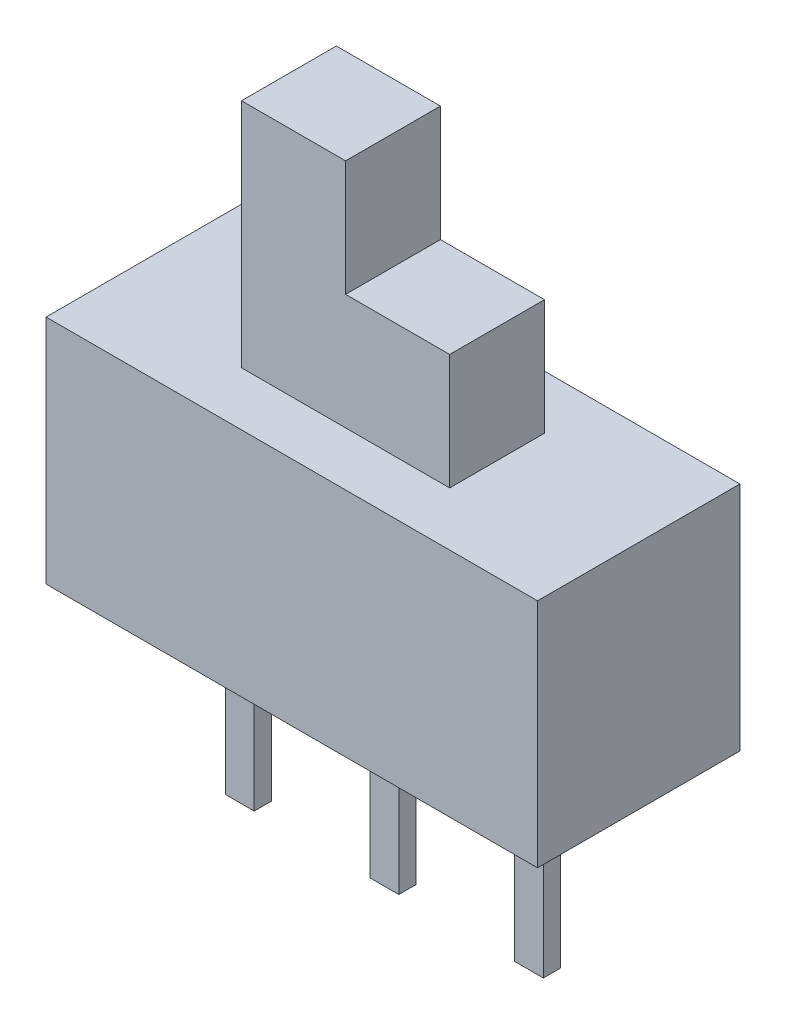
ISO-10303-21;
HEADER;
FILE_DESCRIPTION(('STEP AP214'),'2;1');
FILE_NAME('part.step','',(''),(''),'','','');
FILE_SCHEMA(('AUTOMOTIVE_DESIGN { 1 0 10303 214 1 1 1 1 }'));
ENDSEC;
DATA;
#1=APPLICATION_CONTEXT('core data for automotive mechanical design processes');
#2=APPLICATION_PROTOCOL_DEFINITION('international standard','automotive_design',2000,#1);
#3=PRODUCT_CONTEXT('',#1,'mechanical');
#4=PRODUCT('Part','Part','',(#3));
#5=PRODUCT_RELATED_PRODUCT_CATEGORY('part','',(#4));
#6=PRODUCT_DEFINITION_FORMATION('','',#4);
#7=PRODUCT_DEFINITION_CONTEXT('part definition',#1,'design');
#8=PRODUCT_DEFINITION('design','',#6,#7);
#9=PRODUCT_DEFINITION_SHAPE('','',#8);
#10=(LENGTH_UNIT() NAMED_UNIT(*) SI_UNIT(.MILLI.,.METRE.));
#11=(NAMED_UNIT(*) PLANE_ANGLE_UNIT() SI_UNIT($,.RADIAN.));
#12=(NAMED_UNIT(*) SI_UNIT($,.STERADIAN.) SOLID_ANGLE_UNIT());
#13=UNCERTAINTY_MEASURE_WITH_UNIT(LENGTH_MEASURE(1.E-05),#10,'distance_accuracy_value','');
#14=(GEOMETRIC_REPRESENTATION_CONTEXT(3) GLOBAL_UNCERTAINTY_ASSIGNED_CONTEXT((#13)) GLOBAL_UNIT_ASSIGNED_CONTEXT((#10,
#11,#12)) REPRESENTATION_CONTEXT('',''));
#15=CARTESIAN_POINT('',(0.,0.,0.));
#16=DIRECTION('',(0.,0.,1.));
#17=DIRECTION('',(1.,0.,0.));
#18=AXIS2_PLACEMENT_3D('',#15,#16,#17);
#19=CARTESIAN_POINT('',(1.8,8.,-0.82));
#20=DIRECTION('',(-1.,0.,0.));
#21=DIRECTION('',(0.,0.,1.));
#22=AXIS2_PLACEMENT_3D('',#19,#20,#21);
#23=PLANE('',#22);
#24=DIRECTION('',(0.,0.,-1.));
#25=VECTOR('',#24,1.);
#26=CARTESIAN_POINT('',(1.8,6.,-0.82));
#27=LINE('',#26,#25);
#28=CARTESIAN_POINT('',(1.8,6.,0.82));
#29=VERTEX_POINT('',#28);
#30=CARTESIAN_POINT('',(1.8,6.,-0.82));
#31=VERTEX_POINT('',#30);
#32=EDGE_CURVE('E264',#29,#31,#27,.T.);
#33=ORIENTED_EDGE('',*,*,#32,.F.);
#34=DIRECTION('',(0.,-1.,0.));
#35=VECTOR('',#34,1.);
#36=CARTESIAN_POINT('',(1.8,8.,0.82));
#37=LINE('',#36,#35);
#38=CARTESIAN_POINT('',(1.8,4.,0.82));
#39=VERTEX_POINT('',#38);
#40=EDGE_CURVE('E300',#29,#39,#37,.T.);
#41=ORIENTED_EDGE('',*,*,#40,.T.);
#42=DIRECTION('',(0.,0.,-1.));
#43=VECTOR('',#42,1.);
#44=CARTESIAN_POINT('',(1.8,4.,-0.82));
#45=LINE('',#44,#43);
#46=CARTESIAN_POINT('',(1.8,4.,-0.82));
#47=VERTEX_POINT('',#46);
#48=EDGE_CURVE('E291',#39,#47,#45,.T.);
#49=ORIENTED_EDGE('',*,*,#48,.T.);
#50=DIRECTION('',(0.,-1.,0.));
#51=VECTOR('',#50,1.);
#52=CARTESIAN_POINT('',(1.8,8.,-0.82));
#53=LINE('',#52,#51);
#54=EDGE_CURVE('E298',#31,#47,#53,.T.);
#55=ORIENTED_EDGE('',*,*,#54,.F.);
#56=EDGE_LOOP('',(#33,#41,#49,#55));
#57=FACE_BOUND('',#56,.T.);
#58=ADVANCED_FACE('F35',(#57),#23,.F.);
#59=CARTESIAN_POINT('',(4.25,4.,-1.75));
#60=DIRECTION('',(-1.,0.,0.));
#61=DIRECTION('',(0.,0.,1.));
#62=AXIS2_PLACEMENT_3D('',#59,#60,#61);
#63=PLANE('',#62);
#64=DIRECTION('',(0.,0.,-1.));
#65=VECTOR('',#64,1.);
#66=CARTESIAN_POINT('',(4.25,0.,-1.75));
#67=LINE('',#66,#65);
#68=CARTESIAN_POINT('',(4.25,0.,1.75));
#69=VERTEX_POINT('',#68);
#70=CARTESIAN_POINT('',(4.25,0.,-1.75));
#71=VERTEX_POINT('',#70);
#72=EDGE_CURVE('E305',#69,#71,#67,.T.);
#73=ORIENTED_EDGE('',*,*,#72,.T.);
#74=DIRECTION('',(0.,-1.,0.));
#75=VECTOR('',#74,1.);
#76=CARTESIAN_POINT('',(4.25,4.,-1.75));
#77=LINE('',#76,#75);
#78=CARTESIAN_POINT('',(4.25,4.,-1.75));
#79=VERTEX_POINT('',#78);
#80=EDGE_CURVE('E332',#79,#71,#77,.T.);
#81=ORIENTED_EDGE('',*,*,#80,.F.);
#82=DIRECTION('',(0.,0.,-1.));
#83=VECTOR('',#82,1.);
#84=CARTESIAN_POINT('',(4.25,4.,-1.75));
#85=LINE('',#84,#83);
#86=CARTESIAN_POINT('',(4.25,4.,1.75));
#87=VERTEX_POINT('',#86);
#88=EDGE_CURVE('E306',#87,#79,#85,.T.);
#89=ORIENTED_EDGE('',*,*,#88,.F.);
#90=DIRECTION('',(0.,-1.,0.));
#91=VECTOR('',#90,1.);
#92=CARTESIAN_POINT('',(4.25,4.,1.75));
#93=LINE('',#92,#91);
#94=EDGE_CURVE('E316',#87,#69,#93,.T.);
#95=ORIENTED_EDGE('',*,*,#94,.T.);
#96=EDGE_LOOP('',(#73,#81,#89,#95));
#97=FACE_BOUND('',#96,.T.);
#98=ADVANCED_FACE('F37',(#97),#63,.F.);
#99=CARTESIAN_POINT('',(-4.25,4.,-1.75));
#100=DIRECTION('',(0.,0.,1.));
#101=DIRECTION('',(1.,0.,0.));
#102=AXIS2_PLACEMENT_3D('',#99,#100,#101);
#103=PLANE('',#102);
#104=DIRECTION('',(-1.,0.,0.));
#105=VECTOR('',#104,1.);
#106=CARTESIAN_POINT('',(-4.25,0.,-1.75));
#107=LINE('',#106,#105);
#108=CARTESIAN_POINT('',(-4.25,0.,-1.75));
#109=VERTEX_POINT('',#108);
#110=EDGE_CURVE('E319',#71,#109,#107,.T.);
#111=ORIENTED_EDGE('',*,*,#110,.T.);
#112=DIRECTION('',(0.,-1.,0.));
#113=VECTOR('',#112,1.);
#114=CARTESIAN_POINT('',(-4.25,4.,-1.75));
#115=LINE('',#114,#113);
#116=CARTESIAN_POINT('',(-4.25,4.,-1.75));
#117=VERTEX_POINT('',#116);
#118=EDGE_CURVE('E329',#117,#109,#115,.T.);
#119=ORIENTED_EDGE('',*,*,#118,.F.);
#120=DIRECTION('',(-1.,0.,0.));
#121=VECTOR('',#120,1.);
#122=CARTESIAN_POINT('',(-4.25,4.,-1.75));
#123=LINE('',#122,#121);
#124=EDGE_CURVE('E309',#79,#117,#123,.T.);
#125=ORIENTED_EDGE('',*,*,#124,.F.);
#126=ORIENTED_EDGE('',*,*,#80,.T.);
#127=EDGE_LOOP('',(#111,#119,#125,#126));
#128=FACE_BOUND('',#127,.T.);
#129=ADVANCED_FACE('F384',(#128),#103,.F.);
#130=CARTESIAN_POINT('',(-4.25,4.,-1.75));
#131=DIRECTION('',(1.,0.,0.));
#132=DIRECTION('',(0.,0.,-1.));
#133=AXIS2_PLACEMENT_3D('',#130,#131,#132);
#134=PLANE('',#133);
#135=DIRECTION('',(0.,0.,1.));
#136=VECTOR('',#135,1.);
#137=CARTESIAN_POINT('',(-4.25,0.,-1.75));
#138=LINE('',#137,#136);
#139=CARTESIAN_POINT('',(-4.25,0.,1.75));
#140=VERTEX_POINT('',#139);
#141=EDGE_CURVE('E321',#109,#140,#138,.T.);
#142=ORIENTED_EDGE('',*,*,#141,.T.);
#143=DIRECTION('',(0.,-1.,0.));
#144=VECTOR('',#143,1.);
#145=CARTESIAN_POINT('',(-4.25,4.,1.75));
#146=LINE('',#145,#144);
#147=CARTESIAN_POINT('',(-4.25,4.,1.75));
#148=VERTEX_POINT('',#147);
#149=EDGE_CURVE('E326',#148,#140,#146,.T.);
#150=ORIENTED_EDGE('',*,*,#149,.F.);
#151=DIRECTION('',(0.,0.,1.));
#152=VECTOR('',#151,1.);
#153=CARTESIAN_POINT('',(-4.25,4.,-1.75));
#154=LINE('',#153,#152);
#155=EDGE_CURVE('E312',#117,#148,#154,.T.);
#156=ORIENTED_EDGE('',*,*,#155,.F.);
#157=ORIENTED_EDGE('',*,*,#118,.T.);
#158=EDGE_LOOP('',(#142,#150,#156,#157));
#159=FACE_BOUND('',#158,.T.);
#160=ADVANCED_FACE('F408',(#159),#134,.F.);
#161=CARTESIAN_POINT('',(-4.25,4.,1.75));
#162=DIRECTION('',(0.,0.,-1.));
#163=DIRECTION('',(-1.,0.,0.));
#164=AXIS2_PLACEMENT_3D('',#161,#162,#163);
#165=PLANE('',#164);
#166=DIRECTION('',(1.,0.,0.));
#167=VECTOR('',#166,1.);
#168=CARTESIAN_POINT('',(-4.25,0.,1.75));
#169=LINE('',#168,#167);
#170=EDGE_CURVE('E310',#140,#69,#169,.T.);
#171=ORIENTED_EDGE('',*,*,#170,.T.);
#172=ORIENTED_EDGE('',*,*,#94,.F.);
#173=DIRECTION('',(1.,0.,0.));
#174=VECTOR('',#173,1.);
#175=CARTESIAN_POINT('',(-4.25,4.,1.75));
#176=LINE('',#175,#174);
#177=EDGE_CURVE('E314',#148,#87,#176,.T.);
#178=ORIENTED_EDGE('',*,*,#177,.F.);
#179=ORIENTED_EDGE('',*,*,#149,.T.);
#180=EDGE_LOOP('',(#171,#172,#178,#179));
#181=FACE_BOUND('',#180,.T.);
#182=ADVANCED_FACE('F402',(#181),#165,.F.);
#183=CARTESIAN_POINT('',(0.,4.,0.));
#184=DIRECTION('',(0.,1.,0.));
#185=DIRECTION('',(0.,0.,1.));
#186=AXIS2_PLACEMENT_3D('',#183,#184,#185);
#187=PLANE('',#186);
#188=DIRECTION('',(0.,0.,1.));
#189=VECTOR('',#188,1.);
#190=CARTESIAN_POINT('',(-1.8,4.,-0.82));
#191=LINE('',#190,#189);
#192=CARTESIAN_POINT('',(-1.8,4.,-0.82));
#193=VERTEX_POINT('',#192);
#194=CARTESIAN_POINT('',(-1.8,4.,0.82));
#195=VERTEX_POINT('',#194);
#196=EDGE_CURVE('E273',#193,#195,#191,.T.);
#197=ORIENTED_EDGE('',*,*,#196,.F.);
#198=DIRECTION('',(-1.,0.,0.));
#199=VECTOR('',#198,1.);
#200=CARTESIAN_POINT('',(-1.8,4.,-0.82));
#201=LINE('',#200,#199);
#202=EDGE_CURVE('E280',#47,#193,#201,.T.);
#203=ORIENTED_EDGE('',*,*,#202,.F.);
#204=ORIENTED_EDGE('',*,*,#48,.F.);
#205=DIRECTION('',(1.,0.,0.));
#206=VECTOR('',#205,1.);
#207=CARTESIAN_POINT('',(-1.8,4.,0.82));
#208=LINE('',#207,#206);
#209=EDGE_CURVE('E288',#195,#39,#208,.T.);
#210=ORIENTED_EDGE('',*,*,#209,.F.);
#211=EDGE_LOOP('',(#197,#203,#204,#210));
#212=FACE_BOUND('',#211,.T.);
#213=ORIENTED_EDGE('',*,*,#88,.T.);
#214=ORIENTED_EDGE('',*,*,#124,.T.);
#215=ORIENTED_EDGE('',*,*,#155,.T.);
#216=ORIENTED_EDGE('',*,*,#177,.T.);
#217=EDGE_LOOP('',(#213,#214,#215,#216));
#218=FACE_BOUND('',#217,.T.);
#219=ADVANCED_FACE('F399',(#212,#218),#187,.T.);
#220=CARTESIAN_POINT('',(0.,0.,0.));
#221=DIRECTION('',(0.,1.,0.));
#222=DIRECTION('',(0.,0.,1.));
#223=AXIS2_PLACEMENT_3D('',#220,#221,#222);
#224=PLANE('',#223);
#225=DIRECTION('',(0.,0.,1.));
#226=VECTOR('',#225,1.);
#227=CARTESIAN_POINT('',(-2.75,0.,0.));
#228=LINE('',#227,#226);
#229=CARTESIAN_POINT('',(-2.75,0.,-0.15));
#230=VERTEX_POINT('',#229);
#231=CARTESIAN_POINT('',(-2.75,0.,0.15));
#232=VERTEX_POINT('',#231);
#233=EDGE_CURVE('E43',#230,#232,#228,.T.);
#234=ORIENTED_EDGE('',*,*,#233,.T.);
#235=DIRECTION('',(1.,0.,0.));
#236=VECTOR('',#235,1.);
#237=CARTESIAN_POINT('',(0.,0.,0.15));
#238=LINE('',#237,#236);
#239=CARTESIAN_POINT('',(-2.25,0.,0.15));
#240=VERTEX_POINT('',#239);
#241=EDGE_CURVE('E11',#232,#240,#238,.T.);
#242=ORIENTED_EDGE('',*,*,#241,.T.);
#243=DIRECTION('',(0.,0.,-1.));
#244=VECTOR('',#243,1.);
#245=CARTESIAN_POINT('',(-2.25,0.,0.));
#246=LINE('',#245,#244);
#247=CARTESIAN_POINT('',(-2.25,0.,-0.15));
#248=VERTEX_POINT('',#247);
#249=EDGE_CURVE('E187',#240,#248,#246,.T.);
#250=ORIENTED_EDGE('',*,*,#249,.T.);
#251=DIRECTION('',(-1.,0.,0.));
#252=VECTOR('',#251,1.);
#253=CARTESIAN_POINT('',(0.,0.,-0.15));
#254=LINE('',#253,#252);
#255=EDGE_CURVE('E360',#248,#230,#254,.T.);
#256=ORIENTED_EDGE('',*,*,#255,.T.);
#257=EDGE_LOOP('',(#234,#242,#250,#256));
#258=FACE_BOUND('',#257,.T.);
#259=DIRECTION('',(0.,0.,1.));
#260=VECTOR('',#259,1.);
#261=CARTESIAN_POINT('',(2.25,0.,0.));
#262=LINE('',#261,#260);
#263=CARTESIAN_POINT('',(2.25,0.,-0.15));
#264=VERTEX_POINT('',#263);
#265=CARTESIAN_POINT('',(2.25,0.,0.15));
#266=VERTEX_POINT('',#265);
#267=EDGE_CURVE('E353',#264,#266,#262,.T.);
#268=ORIENTED_EDGE('',*,*,#267,.T.);
#269=DIRECTION('',(1.,0.,0.));
#270=VECTOR('',#269,1.);
#271=CARTESIAN_POINT('',(0.,0.,0.15));
#272=LINE('',#271,#270);
#273=CARTESIAN_POINT('',(2.75,0.,0.15));
#274=VERTEX_POINT('',#273);
#275=EDGE_CURVE('E356',#266,#274,#272,.T.);
#276=ORIENTED_EDGE('',*,*,#275,.T.);
#277=DIRECTION('',(0.,0.,-1.));
#278=VECTOR('',#277,1.);
#279=CARTESIAN_POINT('',(2.75,0.,0.));
#280=LINE('',#279,#278);
#281=CARTESIAN_POINT('',(2.75,0.,-0.15));
#282=VERTEX_POINT('',#281);
#283=EDGE_CURVE('E347',#274,#282,#280,.T.);
#284=ORIENTED_EDGE('',*,*,#283,.T.);
#285=DIRECTION('',(-1.,0.,0.));
#286=VECTOR('',#285,1.);
#287=CARTESIAN_POINT('',(0.,0.,-0.15));
#288=LINE('',#287,#286);
#289=EDGE_CURVE('E350',#282,#264,#288,.T.);
#290=ORIENTED_EDGE('',*,*,#289,.T.);
#291=EDGE_LOOP('',(#268,#276,#284,#290));
#292=FACE_BOUND('',#291,.T.);
#293=DIRECTION('',(0.,0.,1.));
#294=VECTOR('',#293,1.);
#295=CARTESIAN_POINT('',(-0.25,0.,0.));
#296=LINE('',#295,#294);
#297=CARTESIAN_POINT('',(-0.25,0.,-0.15));
#298=VERTEX_POINT('',#297);
#299=CARTESIAN_POINT('',(-0.25,0.,0.15));
#300=VERTEX_POINT('',#299);
#301=EDGE_CURVE('E341',#298,#300,#296,.T.);
#302=ORIENTED_EDGE('',*,*,#301,.T.);
#303=DIRECTION('',(1.,0.,0.));
#304=VECTOR('',#303,1.);
#305=CARTESIAN_POINT('',(0.,0.,0.15));
#306=LINE('',#305,#304);
#307=CARTESIAN_POINT('',(0.25,0.,0.15));
#308=VERTEX_POINT('',#307);
#309=EDGE_CURVE('E344',#300,#308,#306,.T.);
#310=ORIENTED_EDGE('',*,*,#309,.T.);
#311=DIRECTION('',(0.,0.,-1.));
#312=VECTOR('',#311,1.);
#313=CARTESIAN_POINT('',(0.249999999999999,0.,0.));
#314=LINE('',#313,#312);
#315=CARTESIAN_POINT('',(0.249999999999999,0.,-0.15));
#316=VERTEX_POINT('',#315);
#317=EDGE_CURVE('E335',#308,#316,#314,.T.);
#318=ORIENTED_EDGE('',*,*,#317,.T.);
#319=DIRECTION('',(-1.,0.,0.));
#320=VECTOR('',#319,1.);
#321=CARTESIAN_POINT('',(0.,0.,-0.15));
#322=LINE('',#321,#320);
#323=EDGE_CURVE('E338',#316,#298,#322,.T.);
#324=ORIENTED_EDGE('',*,*,#323,.T.);
#325=EDGE_LOOP('',(#302,#310,#318,#324));
#326=FACE_BOUND('',#325,.T.);
#327=ORIENTED_EDGE('',*,*,#72,.F.);
#328=ORIENTED_EDGE('',*,*,#170,.F.);
#329=ORIENTED_EDGE('',*,*,#141,.F.);
#330=ORIENTED_EDGE('',*,*,#110,.F.);
#331=EDGE_LOOP('',(#327,#328,#329,#330));
#332=FACE_BOUND('',#331,.T.);
#333=ADVANCED_FACE('F364',(#258,#292,#326,#332),#224,.F.);
#334=CARTESIAN_POINT('',(-1.8,8.,-0.82));
#335=DIRECTION('',(1.,0.,0.));
#336=DIRECTION('',(0.,0.,-1.));
#337=AXIS2_PLACEMENT_3D('',#334,#335,#336);
#338=PLANE('',#337);
#339=ORIENTED_EDGE('',*,*,#196,.T.);
#340=DIRECTION('',(0.,-1.,0.));
#341=VECTOR('',#340,1.);
#342=CARTESIAN_POINT('',(-1.8,8.,0.82));
#343=LINE('',#342,#341);
#344=CARTESIAN_POINT('',(-1.8,8.,0.82));
#345=VERTEX_POINT('',#344);
#346=EDGE_CURVE('E302',#345,#195,#343,.T.);
#347=ORIENTED_EDGE('',*,*,#346,.F.);
#348=DIRECTION('',(0.,0.,1.));
#349=VECTOR('',#348,1.);
#350=CARTESIAN_POINT('',(-1.8,8.,-0.82));
#351=LINE('',#350,#349);
#352=CARTESIAN_POINT('',(-1.8,8.,-0.82));
#353=VERTEX_POINT('',#352);
#354=EDGE_CURVE('E276',#353,#345,#351,.T.);
#355=ORIENTED_EDGE('',*,*,#354,.F.);
#356=DIRECTION('',(0.,-1.,0.));
#357=VECTOR('',#356,1.);
#358=CARTESIAN_POINT('',(-1.8,8.,-0.82));
#359=LINE('',#358,#357);
#360=EDGE_CURVE('E285',#353,#193,#359,.T.);
#361=ORIENTED_EDGE('',*,*,#360,.T.);
#362=EDGE_LOOP('',(#339,#347,#355,#361));
#363=FACE_BOUND('',#362,.T.);
#364=ADVANCED_FACE('F394',(#363),#338,.F.);
#365=CARTESIAN_POINT('',(-1.8,8.,0.82));
#366=DIRECTION('',(0.,0.,-1.));
#367=DIRECTION('',(-1.,0.,0.));
#368=AXIS2_PLACEMENT_3D('',#365,#366,#367);
#369=PLANE('',#368);
#370=DIRECTION('',(1.,0.,0.));
#371=VECTOR('',#370,1.);
#372=CARTESIAN_POINT('',(0.,6.,0.82));
#373=LINE('',#372,#371);
#374=CARTESIAN_POINT('',(0.,6.,0.82));
#375=VERTEX_POINT('',#374);
#376=EDGE_CURVE('E262',#375,#29,#373,.T.);
#377=ORIENTED_EDGE('',*,*,#376,.F.);
#378=DIRECTION('',(0.,1.,0.));
#379=VECTOR('',#378,1.);
#380=CARTESIAN_POINT('',(0.,6.,0.82));
#381=LINE('',#380,#379);
#382=CARTESIAN_POINT('',(0.,8.,0.82));
#383=VERTEX_POINT('',#382);
#384=EDGE_CURVE('E269',#375,#383,#381,.T.);
#385=ORIENTED_EDGE('',*,*,#384,.T.);
#386=DIRECTION('',(1.,0.,0.));
#387=VECTOR('',#386,1.);
#388=CARTESIAN_POINT('',(-1.8,8.,0.82));
#389=LINE('',#388,#387);
#390=EDGE_CURVE('E279',#345,#383,#389,.T.);
#391=ORIENTED_EDGE('',*,*,#390,.F.);
#392=ORIENTED_EDGE('',*,*,#346,.T.);
#393=ORIENTED_EDGE('',*,*,#209,.T.);
#394=ORIENTED_EDGE('',*,*,#40,.F.);
#395=EDGE_LOOP('',(#377,#385,#391,#392,#393,#394));
#396=FACE_BOUND('',#395,.T.);
#397=ADVANCED_FACE('F391',(#396),#369,.F.);
#398=CARTESIAN_POINT('',(-1.8,8.,-0.82));
#399=DIRECTION('',(0.,0.,1.));
#400=DIRECTION('',(1.,0.,0.));
#401=AXIS2_PLACEMENT_3D('',#398,#399,#400);
#402=PLANE('',#401);
#403=DIRECTION('',(-1.,0.,0.));
#404=VECTOR('',#403,1.);
#405=CARTESIAN_POINT('',(-1.8,8.,-0.82));
#406=LINE('',#405,#404);
#407=CARTESIAN_POINT('',(0.,8.,-0.82));
#408=VERTEX_POINT('',#407);
#409=EDGE_CURVE('E283',#408,#353,#406,.T.);
#410=ORIENTED_EDGE('',*,*,#409,.F.);
#411=DIRECTION('',(0.,1.,0.));
#412=VECTOR('',#411,1.);
#413=CARTESIAN_POINT('',(0.,6.,-0.82));
#414=LINE('',#413,#412);
#415=CARTESIAN_POINT('',(0.,6.,-0.82));
#416=VERTEX_POINT('',#415);
#417=EDGE_CURVE('E271',#416,#408,#414,.T.);
#418=ORIENTED_EDGE('',*,*,#417,.F.);
#419=DIRECTION('',(-1.,0.,0.));
#420=VECTOR('',#419,1.);
#421=CARTESIAN_POINT('',(0.,6.,-0.82));
#422=LINE('',#421,#420);
#423=EDGE_CURVE('E266',#31,#416,#422,.T.);
#424=ORIENTED_EDGE('',*,*,#423,.F.);
#425=ORIENTED_EDGE('',*,*,#54,.T.);
#426=ORIENTED_EDGE('',*,*,#202,.T.);
#427=ORIENTED_EDGE('',*,*,#360,.F.);
#428=EDGE_LOOP('',(#410,#418,#424,#425,#426,#427));
#429=FACE_BOUND('',#428,.T.);
#430=ADVANCED_FACE('F389',(#429),#402,.F.);
#431=CARTESIAN_POINT('',(0.,8.,0.));
#432=DIRECTION('',(0.,1.,0.));
#433=DIRECTION('',(0.,0.,1.));
#434=AXIS2_PLACEMENT_3D('',#431,#432,#433);
#435=PLANE('',#434);
#436=DIRECTION('',(0.,0.,1.));
#437=VECTOR('',#436,1.);
#438=CARTESIAN_POINT('',(0.,8.,-0.82));
#439=LINE('',#438,#437);
#440=EDGE_CURVE('E251',#408,#383,#439,.T.);
#441=ORIENTED_EDGE('',*,*,#440,.F.);
#442=ORIENTED_EDGE('',*,*,#409,.T.);
#443=ORIENTED_EDGE('',*,*,#354,.T.);
#444=ORIENTED_EDGE('',*,*,#390,.T.);
#445=EDGE_LOOP('',(#441,#442,#443,#444));
#446=FACE_BOUND('',#445,.T.);
#447=ADVANCED_FACE('F462',(#446),#435,.T.);
#448=CARTESIAN_POINT('',(0.,6.,-0.82));
#449=DIRECTION('',(-1.,0.,0.));
#450=DIRECTION('',(0.,0.,1.));
#451=AXIS2_PLACEMENT_3D('',#448,#449,#450);
#452=PLANE('',#451);
#453=ORIENTED_EDGE('',*,*,#440,.T.);
#454=ORIENTED_EDGE('',*,*,#384,.F.);
#455=DIRECTION('',(0.,0.,1.));
#456=VECTOR('',#455,1.);
#457=CARTESIAN_POINT('',(0.,6.,-0.82));
#458=LINE('',#457,#456);
#459=EDGE_CURVE('E259',#416,#375,#458,.T.);
#460=ORIENTED_EDGE('',*,*,#459,.F.);
#461=ORIENTED_EDGE('',*,*,#417,.T.);
#462=EDGE_LOOP('',(#453,#454,#460,#461));
#463=FACE_BOUND('',#462,.T.);
#464=ADVANCED_FACE('F469',(#463),#452,.F.);
#465=CARTESIAN_POINT('',(0.,6.,0.));
#466=DIRECTION('',(0.,1.,0.));
#467=DIRECTION('',(0.,0.,1.));
#468=AXIS2_PLACEMENT_3D('',#465,#466,#467);
#469=PLANE('',#468);
#470=ORIENTED_EDGE('',*,*,#459,.T.);
#471=ORIENTED_EDGE('',*,*,#376,.T.);
#472=ORIENTED_EDGE('',*,*,#32,.T.);
#473=ORIENTED_EDGE('',*,*,#423,.T.);
#474=EDGE_LOOP('',(#470,#471,#472,#473));
#475=FACE_BOUND('',#474,.T.);
#476=ADVANCED_FACE('F476',(#475),#469,.T.);
#477=CARTESIAN_POINT('',(0.,-3.2,0.15));
#478=DIRECTION('',(0.,0.,1.));
#479=DIRECTION('',(1.,0.,0.));
#480=AXIS2_PLACEMENT_3D('',#477,#478,#479);
#481=PLANE('',#480);
#482=ORIENTED_EDGE('',*,*,#309,.F.);
#483=DIRECTION('',(0.,1.,0.));
#484=VECTOR('',#483,1.);
#485=CARTESIAN_POINT('',(-0.25,-3.2,0.15));
#486=LINE('',#485,#484);
#487=CARTESIAN_POINT('',(-0.25,-3.2,0.15));
#488=VERTEX_POINT('',#487);
#489=EDGE_CURVE('E248',#488,#300,#486,.T.);
#490=ORIENTED_EDGE('',*,*,#489,.F.);
#491=DIRECTION('',(1.,0.,0.));
#492=VECTOR('',#491,1.);
#493=CARTESIAN_POINT('',(0.,-3.2,0.15));
#494=LINE('',#493,#492);
#495=CARTESIAN_POINT('',(0.25,-3.2,0.15));
#496=VERTEX_POINT('',#495);
#497=EDGE_CURVE('E229',#488,#496,#494,.T.);
#498=ORIENTED_EDGE('',*,*,#497,.T.);
#499=DIRECTION('',(0.,1.,0.));
#500=VECTOR('',#499,1.);
#501=CARTESIAN_POINT('',(0.25,-3.2,0.15));
#502=LINE('',#501,#500);
#503=EDGE_CURVE('E247',#496,#308,#502,.T.);
#504=ORIENTED_EDGE('',*,*,#503,.T.);
#505=EDGE_LOOP('',(#482,#490,#498,#504));
#506=FACE_BOUND('',#505,.T.);
#507=ADVANCED_FACE('F483',(#506),#481,.T.);
#508=CARTESIAN_POINT('',(-0.25,-3.2,0.));
#509=DIRECTION('',(-1.,0.,0.));
#510=DIRECTION('',(0.,0.,1.));
#511=AXIS2_PLACEMENT_3D('',#508,#509,#510);
#512=PLANE('',#511);
#513=ORIENTED_EDGE('',*,*,#301,.F.);
#514=DIRECTION('',(0.,1.,0.));
#515=VECTOR('',#514,1.);
#516=CARTESIAN_POINT('',(-0.25,-3.2,-0.15));
#517=LINE('',#516,#515);
#518=CARTESIAN_POINT('',(-0.25,-3.2,-0.15));
#519=VERTEX_POINT('',#518);
#520=EDGE_CURVE('E252',#519,#298,#517,.T.);
#521=ORIENTED_EDGE('',*,*,#520,.F.);
#522=DIRECTION('',(0.,0.,1.));
#523=VECTOR('',#522,1.);
#524=CARTESIAN_POINT('',(-0.25,-3.2,0.));
#525=LINE('',#524,#523);
#526=EDGE_CURVE('E244',#519,#488,#525,.T.);
#527=ORIENTED_EDGE('',*,*,#526,.T.);
#528=ORIENTED_EDGE('',*,*,#489,.T.);
#529=EDGE_LOOP('',(#513,#521,#527,#528));
#530=FACE_BOUND('',#529,.T.);
#531=ADVANCED_FACE('F490',(#530),#512,.T.);
#532=CARTESIAN_POINT('',(0.,-3.2,-0.15));
#533=DIRECTION('',(0.,0.,-1.));
#534=DIRECTION('',(-1.,0.,0.));
#535=AXIS2_PLACEMENT_3D('',#532,#533,#534);
#536=PLANE('',#535);
#537=ORIENTED_EDGE('',*,*,#323,.F.);
#538=DIRECTION('',(0.,1.,0.));
#539=VECTOR('',#538,1.);
#540=CARTESIAN_POINT('',(0.249999999999999,-3.2,-0.15));
#541=LINE('',#540,#539);
#542=CARTESIAN_POINT('',(0.249999999999999,-3.2,-0.15));
#543=VERTEX_POINT('',#542);
#544=EDGE_CURVE('E255',#543,#316,#541,.T.);
#545=ORIENTED_EDGE('',*,*,#544,.F.);
#546=DIRECTION('',(-1.,0.,0.));
#547=VECTOR('',#546,1.);
#548=CARTESIAN_POINT('',(0.,-3.2,-0.15));
#549=LINE('',#548,#547);
#550=EDGE_CURVE('E241',#543,#519,#549,.T.);
#551=ORIENTED_EDGE('',*,*,#550,.T.);
#552=ORIENTED_EDGE('',*,*,#520,.T.);
#553=EDGE_LOOP('',(#537,#545,#551,#552));
#554=FACE_BOUND('',#553,.T.);
#555=ADVANCED_FACE('F498',(#554),#536,.T.);
#556=CARTESIAN_POINT('',(0.249999999999999,-3.2,0.));
#557=DIRECTION('',(1.,0.,0.));
#558=DIRECTION('',(0.,0.,-1.));
#559=AXIS2_PLACEMENT_3D('',#556,#557,#558);
#560=PLANE('',#559);
#561=ORIENTED_EDGE('',*,*,#317,.F.);
#562=ORIENTED_EDGE('',*,*,#503,.F.);
#563=DIRECTION('',(0.,0.,-1.));
#564=VECTOR('',#563,1.);
#565=CARTESIAN_POINT('',(0.249999999999999,-3.2,0.));
#566=LINE('',#565,#564);
#567=EDGE_CURVE('E238',#496,#543,#566,.T.);
#568=ORIENTED_EDGE('',*,*,#567,.T.);
#569=ORIENTED_EDGE('',*,*,#544,.T.);
#570=EDGE_LOOP('',(#561,#562,#568,#569));
#571=FACE_BOUND('',#570,.T.);
#572=ADVANCED_FACE('F506',(#571),#560,.T.);
#573=CARTESIAN_POINT('',(0.,-3.2,0.));
#574=DIRECTION('',(0.,1.,0.));
#575=DIRECTION('',(0.,0.,1.));
#576=AXIS2_PLACEMENT_3D('',#573,#574,#575);
#577=PLANE('',#576);
#578=ORIENTED_EDGE('',*,*,#497,.F.);
#579=ORIENTED_EDGE('',*,*,#526,.F.);
#580=ORIENTED_EDGE('',*,*,#550,.F.);
#581=ORIENTED_EDGE('',*,*,#567,.F.);
#582=EDGE_LOOP('',(#578,#579,#580,#581));
#583=FACE_BOUND('',#582,.T.);
#584=ADVANCED_FACE('F514',(#583),#577,.F.);
#585=CARTESIAN_POINT('',(0.,-3.2,0.15));
#586=DIRECTION('',(0.,0.,1.));
#587=DIRECTION('',(1.,0.,0.));
#588=AXIS2_PLACEMENT_3D('',#585,#586,#587);
#589=PLANE('',#588);
#590=ORIENTED_EDGE('',*,*,#275,.F.);
#591=DIRECTION('',(0.,1.,0.));
#592=VECTOR('',#591,1.);
#593=CARTESIAN_POINT('',(2.25,-3.2,0.15));
#594=LINE('',#593,#592);
#595=CARTESIAN_POINT('',(2.25,-3.2,0.15));
#596=VERTEX_POINT('',#595);
#597=EDGE_CURVE('E226',#596,#266,#594,.T.);
#598=ORIENTED_EDGE('',*,*,#597,.F.);
#599=DIRECTION('',(1.,0.,0.));
#600=VECTOR('',#599,1.);
#601=CARTESIAN_POINT('',(0.,-3.2,0.15));
#602=LINE('',#601,#600);
#603=CARTESIAN_POINT('',(2.75,-3.2,0.15));
#604=VERTEX_POINT('',#603);
#605=EDGE_CURVE('E210',#596,#604,#602,.T.);
#606=ORIENTED_EDGE('',*,*,#605,.T.);
#607=DIRECTION('',(0.,1.,0.));
#608=VECTOR('',#607,1.);
#609=CARTESIAN_POINT('',(2.75,-3.2,0.15));
#610=LINE('',#609,#608);
#611=EDGE_CURVE('E225',#604,#274,#610,.T.);
#612=ORIENTED_EDGE('',*,*,#611,.T.);
#613=EDGE_LOOP('',(#590,#598,#606,#612));
#614=FACE_BOUND('',#613,.T.);
#615=ADVANCED_FACE('F522',(#614),#589,.T.);
#616=CARTESIAN_POINT('',(2.25,-3.2,0.));
#617=DIRECTION('',(-1.,0.,0.));
#618=DIRECTION('',(0.,0.,1.));
#619=AXIS2_PLACEMENT_3D('',#616,#617,#618);
#620=PLANE('',#619);
#621=ORIENTED_EDGE('',*,*,#267,.F.);
#622=DIRECTION('',(0.,1.,0.));
#623=VECTOR('',#622,1.);
#624=CARTESIAN_POINT('',(2.25,-3.2,-0.15));
#625=LINE('',#624,#623);
#626=CARTESIAN_POINT('',(2.25,-3.2,-0.15));
#627=VERTEX_POINT('',#626);
#628=EDGE_CURVE('E230',#627,#264,#625,.T.);
#629=ORIENTED_EDGE('',*,*,#628,.F.);
#630=DIRECTION('',(0.,0.,1.));
#631=VECTOR('',#630,1.);
#632=CARTESIAN_POINT('',(2.25,-3.2,0.));
#633=LINE('',#632,#631);
#634=EDGE_CURVE('E222',#627,#596,#633,.T.);
#635=ORIENTED_EDGE('',*,*,#634,.T.);
#636=ORIENTED_EDGE('',*,*,#597,.T.);
#637=EDGE_LOOP('',(#621,#629,#635,#636));
#638=FACE_BOUND('',#637,.T.);
#639=ADVANCED_FACE('F530',(#638),#620,.T.);
#640=CARTESIAN_POINT('',(0.,-3.2,-0.15));
#641=DIRECTION('',(0.,0.,-1.));
#642=DIRECTION('',(-1.,0.,0.));
#643=AXIS2_PLACEMENT_3D('',#640,#641,#642);
#644=PLANE('',#643);
#645=ORIENTED_EDGE('',*,*,#289,.F.);
#646=DIRECTION('',(0.,1.,0.));
#647=VECTOR('',#646,1.);
#648=CARTESIAN_POINT('',(2.75,-3.2,-0.15));
#649=LINE('',#648,#647);
#650=CARTESIAN_POINT('',(2.75,-3.2,-0.15));
#651=VERTEX_POINT('',#650);
#652=EDGE_CURVE('E58',#651,#282,#649,.T.);
#653=ORIENTED_EDGE('',*,*,#652,.F.);
#654=DIRECTION('',(-1.,0.,0.));
#655=VECTOR('',#654,1.);
#656=CARTESIAN_POINT('',(0.,-3.2,-0.15));
#657=LINE('',#656,#655);
#658=EDGE_CURVE('E219',#651,#627,#657,.T.);
#659=ORIENTED_EDGE('',*,*,#658,.T.);
#660=ORIENTED_EDGE('',*,*,#628,.T.);
#661=EDGE_LOOP('',(#645,#653,#659,#660));
#662=FACE_BOUND('',#661,.T.);
#663=ADVANCED_FACE('F538',(#662),#644,.T.);
#664=CARTESIAN_POINT('',(2.75,-3.2,0.));
#665=DIRECTION('',(1.,0.,0.));
#666=DIRECTION('',(0.,0.,-1.));
#667=AXIS2_PLACEMENT_3D('',#664,#665,#666);
#668=PLANE('',#667);
#669=ORIENTED_EDGE('',*,*,#283,.F.);
#670=ORIENTED_EDGE('',*,*,#611,.F.);
#671=DIRECTION('',(0.,0.,-1.));
#672=VECTOR('',#671,1.);
#673=CARTESIAN_POINT('',(2.75,-3.2,0.));
#674=LINE('',#673,#672);
#675=EDGE_CURVE('E217',#604,#651,#674,.T.);
#676=ORIENTED_EDGE('',*,*,#675,.T.);
#677=ORIENTED_EDGE('',*,*,#652,.T.);
#678=EDGE_LOOP('',(#669,#670,#676,#677));
#679=FACE_BOUND('',#678,.T.);
#680=ADVANCED_FACE('F546',(#679),#668,.T.);
#681=CARTESIAN_POINT('',(0.,-3.2,0.));
#682=DIRECTION('',(0.,1.,0.));
#683=DIRECTION('',(0.,0.,1.));
#684=AXIS2_PLACEMENT_3D('',#681,#682,#683);
#685=PLANE('',#684);
#686=ORIENTED_EDGE('',*,*,#605,.F.);
#687=ORIENTED_EDGE('',*,*,#634,.F.);
#688=ORIENTED_EDGE('',*,*,#658,.F.);
#689=ORIENTED_EDGE('',*,*,#675,.F.);
#690=EDGE_LOOP('',(#686,#687,#688,#689));
#691=FACE_BOUND('',#690,.T.);
#692=ADVANCED_FACE('F554',(#691),#685,.F.);
#693=CARTESIAN_POINT('',(0.,-3.2,0.15));
#694=DIRECTION('',(0.,0.,1.));
#695=DIRECTION('',(1.,0.,0.));
#696=AXIS2_PLACEMENT_3D('',#693,#694,#695);
#697=PLANE('',#696);
#698=ORIENTED_EDGE('',*,*,#241,.F.);
#699=DIRECTION('',(0.,1.,0.));
#700=VECTOR('',#699,1.);
#701=CARTESIAN_POINT('',(-2.75,-3.2,0.15));
#702=LINE('',#701,#700);
#703=CARTESIAN_POINT('',(-2.75,-3.2,0.15));
#704=VERTEX_POINT('',#703);
#705=EDGE_CURVE('E204',#704,#232,#702,.T.);
#706=ORIENTED_EDGE('',*,*,#705,.F.);
#707=DIRECTION('',(1.,0.,0.));
#708=VECTOR('',#707,1.);
#709=CARTESIAN_POINT('',(0.,-3.2,0.15));
#710=LINE('',#709,#708);
#711=CARTESIAN_POINT('',(-2.25,-3.2,0.15));
#712=VERTEX_POINT('',#711);
#713=EDGE_CURVE('E197',#704,#712,#710,.T.);
#714=ORIENTED_EDGE('',*,*,#713,.T.);
#715=DIRECTION('',(0.,1.,0.));
#716=VECTOR('',#715,1.);
#717=CARTESIAN_POINT('',(-2.25,-3.2,0.15));
#718=LINE('',#717,#716);
#719=EDGE_CURVE('E182',#712,#240,#718,.T.);
#720=ORIENTED_EDGE('',*,*,#719,.T.);
#721=EDGE_LOOP('',(#698,#706,#714,#720));
#722=FACE_BOUND('',#721,.T.);
#723=ADVANCED_FACE('F202',(#722),#697,.T.);
#724=CARTESIAN_POINT('',(-2.75,-3.2,0.));
#725=DIRECTION('',(-1.,0.,0.));
#726=DIRECTION('',(0.,0.,1.));
#727=AXIS2_PLACEMENT_3D('',#724,#725,#726);
#728=PLANE('',#727);
#729=ORIENTED_EDGE('',*,*,#233,.F.);
#730=DIRECTION('',(0.,1.,0.));
#731=VECTOR('',#730,1.);
#732=CARTESIAN_POINT('',(-2.75,-3.2,-0.15));
#733=LINE('',#732,#731);
#734=CARTESIAN_POINT('',(-2.75,-3.2,-0.15));
#735=VERTEX_POINT('',#734);
#736=EDGE_CURVE('E211',#735,#230,#733,.T.);
#737=ORIENTED_EDGE('',*,*,#736,.F.);
#738=DIRECTION('',(0.,0.,1.));
#739=VECTOR('',#738,1.);
#740=CARTESIAN_POINT('',(-2.75,-3.2,0.));
#741=LINE('',#740,#739);
#742=EDGE_CURVE('E190',#735,#704,#741,.T.);
#743=ORIENTED_EDGE('',*,*,#742,.T.);
#744=ORIENTED_EDGE('',*,*,#705,.T.);
#745=EDGE_LOOP('',(#729,#737,#743,#744));
#746=FACE_BOUND('',#745,.T.);
#747=ADVANCED_FACE('F367',(#746),#728,.T.);
#748=CARTESIAN_POINT('',(0.,-3.2,-0.15));
#749=DIRECTION('',(0.,0.,-1.));
#750=DIRECTION('',(-1.,0.,0.));
#751=AXIS2_PLACEMENT_3D('',#748,#749,#750);
#752=PLANE('',#751);
#753=ORIENTED_EDGE('',*,*,#255,.F.);
#754=DIRECTION('',(0.,1.,0.));
#755=VECTOR('',#754,1.);
#756=CARTESIAN_POINT('',(-2.25,-3.2,-0.15));
#757=LINE('',#756,#755);
#758=CARTESIAN_POINT('',(-2.25,-3.2,-0.15));
#759=VERTEX_POINT('',#758);
#760=EDGE_CURVE('E50',#759,#248,#757,.T.);
#761=ORIENTED_EDGE('',*,*,#760,.F.);
#762=DIRECTION('',(-1.,0.,0.));
#763=VECTOR('',#762,1.);
#764=CARTESIAN_POINT('',(0.,-3.2,-0.15));
#765=LINE('',#764,#763);
#766=EDGE_CURVE('E200',#759,#735,#765,.T.);
#767=ORIENTED_EDGE('',*,*,#766,.T.);
#768=ORIENTED_EDGE('',*,*,#736,.T.);
#769=EDGE_LOOP('',(#753,#761,#767,#768));
#770=FACE_BOUND('',#769,.T.);
#771=ADVANCED_FACE('F369',(#770),#752,.T.);
#772=CARTESIAN_POINT('',(-2.25,-3.2,0.));
#773=DIRECTION('',(1.,0.,0.));
#774=DIRECTION('',(0.,0.,-1.));
#775=AXIS2_PLACEMENT_3D('',#772,#773,#774);
#776=PLANE('',#775);
#777=ORIENTED_EDGE('',*,*,#249,.F.);
#778=ORIENTED_EDGE('',*,*,#719,.F.);
#779=DIRECTION('',(0.,0.,-1.));
#780=VECTOR('',#779,1.);
#781=CARTESIAN_POINT('',(-2.25,-3.2,0.));
#782=LINE('',#781,#780);
#783=EDGE_CURVE('E185',#712,#759,#782,.T.);
#784=ORIENTED_EDGE('',*,*,#783,.T.);
#785=ORIENTED_EDGE('',*,*,#760,.T.);
#786=EDGE_LOOP('',(#777,#778,#784,#785));
#787=FACE_BOUND('',#786,.T.);
#788=ADVANCED_FACE('F184',(#787),#776,.T.);
#789=CARTESIAN_POINT('',(0.,-3.2,0.));
#790=DIRECTION('',(0.,1.,0.));
#791=DIRECTION('',(0.,0.,1.));
#792=AXIS2_PLACEMENT_3D('',#789,#790,#791);
#793=PLANE('',#792);
#794=ORIENTED_EDGE('',*,*,#713,.F.);
#795=ORIENTED_EDGE('',*,*,#742,.F.);
#796=ORIENTED_EDGE('',*,*,#766,.F.);
#797=ORIENTED_EDGE('',*,*,#783,.F.);
#798=EDGE_LOOP('',(#794,#795,#796,#797));
#799=FACE_BOUND('',#798,.T.);
#800=ADVANCED_FACE('F195',(#799),#793,.F.);
#801=CLOSED_SHELL('',(#58,#98,#129,#160,#182,#219,#333,#364,#397,#430,#447,#464,#476,#507,#531,
#555,#572,#584,#615,#639,#663,#680,#692,#723,#747,#771,#788,#800));
#802=MANIFOLD_SOLID_BREP('B2',#801);
#803=ADVANCED_BREP_SHAPE_REPRESENTATION('',(#18,#802),#14);
#804=SHAPE_DEFINITION_REPRESENTATION(#9,#803);
ENDSEC;
END-ISO-10303-21;
